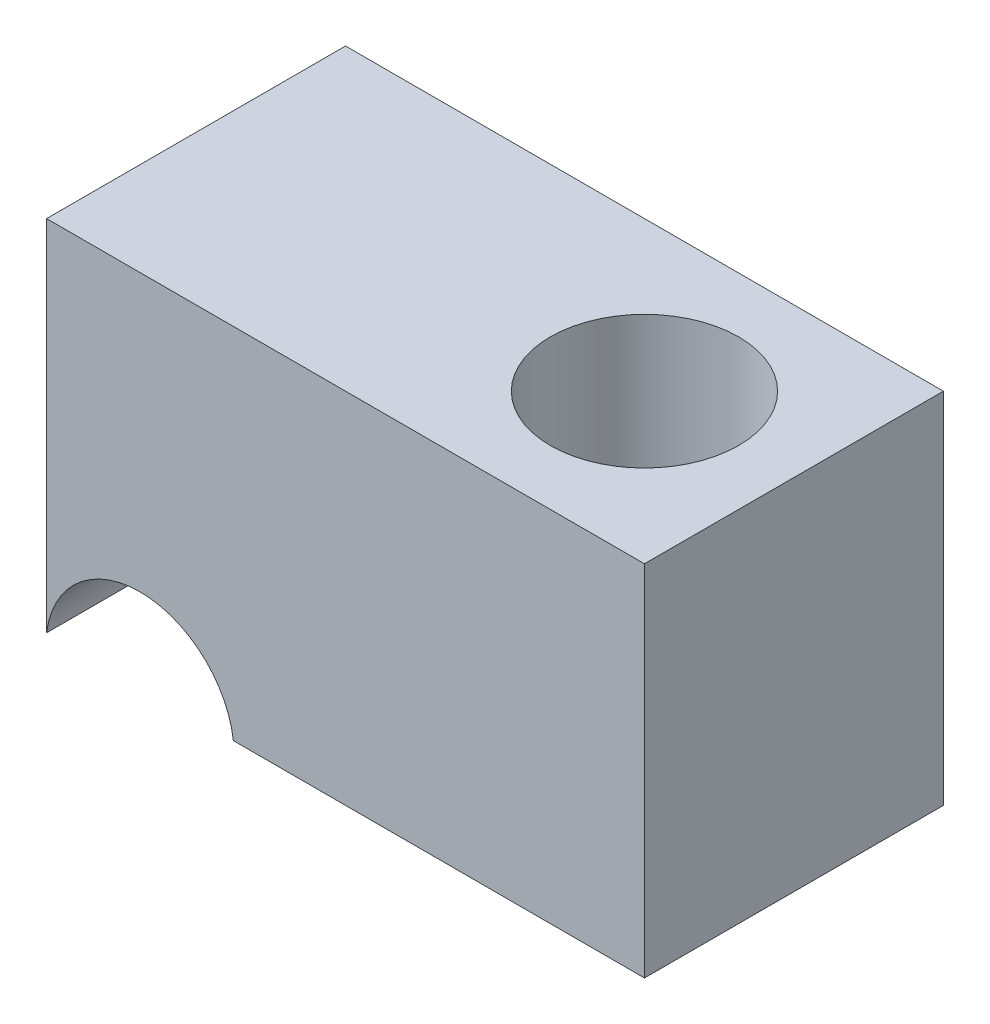
ISO-10303-21;
HEADER;
FILE_DESCRIPTION(('STEP AP214'),'2;1');
FILE_NAME('part.step','',(''),(''),'','','');
FILE_SCHEMA(('AUTOMOTIVE_DESIGN { 1 0 10303 214 1 1 1 1 }'));
ENDSEC;
DATA;
#1=APPLICATION_CONTEXT('core data for automotive mechanical design processes');
#2=APPLICATION_PROTOCOL_DEFINITION('international standard','automotive_design',2000,#1);
#3=PRODUCT_CONTEXT('',#1,'mechanical');
#4=PRODUCT('Part','Part','',(#3));
#5=PRODUCT_RELATED_PRODUCT_CATEGORY('part','',(#4));
#6=PRODUCT_DEFINITION_FORMATION('','',#4);
#7=PRODUCT_DEFINITION_CONTEXT('part definition',#1,'design');
#8=PRODUCT_DEFINITION('design','',#6,#7);
#9=PRODUCT_DEFINITION_SHAPE('','',#8);
#10=(LENGTH_UNIT() NAMED_UNIT(*) SI_UNIT(.MILLI.,.METRE.));
#11=(NAMED_UNIT(*) PLANE_ANGLE_UNIT() SI_UNIT($,.RADIAN.));
#12=(NAMED_UNIT(*) SI_UNIT($,.STERADIAN.) SOLID_ANGLE_UNIT());
#13=UNCERTAINTY_MEASURE_WITH_UNIT(LENGTH_MEASURE(1.E-05),#10,'distance_accuracy_value','');
#14=(GEOMETRIC_REPRESENTATION_CONTEXT(3) GLOBAL_UNCERTAINTY_ASSIGNED_CONTEXT((#13)) GLOBAL_UNIT_ASSIGNED_CONTEXT((#10,
#11,#12)) REPRESENTATION_CONTEXT('',''));
#15=CARTESIAN_POINT('',(0.,0.,0.));
#16=DIRECTION('',(0.,0.,1.));
#17=DIRECTION('',(1.,0.,0.));
#18=AXIS2_PLACEMENT_3D('',#15,#16,#17);
#19=CARTESIAN_POINT('',(0.,0.,6.35));
#20=DIRECTION('',(-1.,0.,0.));
#21=DIRECTION('',(0.,0.,1.));
#22=AXIS2_PLACEMENT_3D('',#19,#20,#21);
#23=PLANE('',#22);
#24=DIRECTION('',(0.,1.,0.));
#25=VECTOR('',#24,1.);
#26=CARTESIAN_POINT('',(0.,0.,0.));
#27=LINE('',#26,#25);
#28=CARTESIAN_POINT('',(0.,0.,0.));
#29=VERTEX_POINT('',#28);
#30=CARTESIAN_POINT('',(0.,7.62,0.));
#31=VERTEX_POINT('',#30);
#32=EDGE_CURVE('E122',#29,#31,#27,.T.);
#33=ORIENTED_EDGE('',*,*,#32,.T.);
#34=DIRECTION('',(0.,0.,-1.));
#35=VECTOR('',#34,1.);
#36=CARTESIAN_POINT('',(0.,7.62,6.35));
#37=LINE('',#36,#35);
#38=CARTESIAN_POINT('',(0.,7.62,6.35));
#39=VERTEX_POINT('',#38);
#40=EDGE_CURVE('E11',#39,#31,#37,.T.);
#41=ORIENTED_EDGE('',*,*,#40,.F.);
#42=DIRECTION('',(0.,1.,0.));
#43=VECTOR('',#42,1.);
#44=CARTESIAN_POINT('',(0.,0.,6.35));
#45=LINE('',#44,#43);
#46=CARTESIAN_POINT('',(0.,0.,6.35));
#47=VERTEX_POINT('',#46);
#48=EDGE_CURVE('E136',#47,#39,#45,.T.);
#49=ORIENTED_EDGE('',*,*,#48,.F.);
#50=DIRECTION('',(0.,0.,-1.));
#51=VECTOR('',#50,1.);
#52=CARTESIAN_POINT('',(0.,0.,6.35));
#53=LINE('',#52,#51);
#54=EDGE_CURVE('E118',#47,#29,#53,.T.);
#55=ORIENTED_EDGE('',*,*,#54,.T.);
#56=EDGE_LOOP('',(#33,#41,#49,#55));
#57=FACE_BOUND('',#56,.T.);
#58=ADVANCED_FACE('F43',(#57),#23,.F.);
#59=CARTESIAN_POINT('',(0.,7.62,6.35));
#60=DIRECTION('',(0.,-1.,0.));
#61=DIRECTION('',(1.,0.,0.));
#62=AXIS2_PLACEMENT_3D('',#59,#60,#61);
#63=PLANE('',#62);
#64=CARTESIAN_POINT('',(-3.175,7.62,3.175));
#65=DIRECTION('',(0.,-1.,0.));
#66=DIRECTION('',(0.,0.,-1.));
#67=AXIS2_PLACEMENT_3D('',#64,#65,#66);
#68=CIRCLE('',#67,2.);
#69=CARTESIAN_POINT('',(-3.175,7.62,1.175));
#70=VERTEX_POINT('',#69);
#71=EDGE_CURVE('E127',#70,#70,#68,.T.);
#72=ORIENTED_EDGE('',*,*,#71,.T.);
#73=EDGE_LOOP('',(#72));
#74=FACE_BOUND('',#73,.T.);
#75=DIRECTION('',(-1.,0.,0.));
#76=VECTOR('',#75,1.);
#77=CARTESIAN_POINT('',(0.,7.62,0.));
#78=LINE('',#77,#76);
#79=CARTESIAN_POINT('',(-12.7,7.62,0.));
#80=VERTEX_POINT('',#79);
#81=EDGE_CURVE('E126',#31,#80,#78,.T.);
#82=ORIENTED_EDGE('',*,*,#81,.T.);
#83=DIRECTION('',(0.,0.,-1.));
#84=VECTOR('',#83,1.);
#85=CARTESIAN_POINT('',(-12.7,7.62,6.35));
#86=LINE('',#85,#84);
#87=CARTESIAN_POINT('',(-12.7,7.62,6.35));
#88=VERTEX_POINT('',#87);
#89=EDGE_CURVE('E52',#88,#80,#86,.T.);
#90=ORIENTED_EDGE('',*,*,#89,.F.);
#91=DIRECTION('',(-1.,0.,0.));
#92=VECTOR('',#91,1.);
#93=CARTESIAN_POINT('',(0.,7.62,6.35));
#94=LINE('',#93,#92);
#95=EDGE_CURVE('E94',#39,#88,#94,.T.);
#96=ORIENTED_EDGE('',*,*,#95,.F.);
#97=ORIENTED_EDGE('',*,*,#40,.T.);
#98=EDGE_LOOP('',(#82,#90,#96,#97));
#99=FACE_BOUND('',#98,.T.);
#100=ADVANCED_FACE('F160',(#74,#99),#63,.F.);
#101=CARTESIAN_POINT('',(-12.7,7.62,6.35));
#102=DIRECTION('',(1.,0.,0.));
#103=DIRECTION('',(0.,1.,0.));
#104=AXIS2_PLACEMENT_3D('',#101,#102,#103);
#105=PLANE('',#104);
#106=DIRECTION('',(0.,-1.,0.));
#107=VECTOR('',#106,1.);
#108=CARTESIAN_POINT('',(-12.7,7.62,0.));
#109=LINE('',#108,#107);
#110=CARTESIAN_POINT('',(-12.7,0.,0.));
#111=VERTEX_POINT('',#110);
#112=EDGE_CURVE('E110',#80,#111,#109,.T.);
#113=ORIENTED_EDGE('',*,*,#112,.T.);
#114=DIRECTION('',(0.,0.,-1.));
#115=VECTOR('',#114,1.);
#116=CARTESIAN_POINT('',(-12.7,0.,6.35));
#117=LINE('',#116,#115);
#118=CARTESIAN_POINT('',(-12.7,0.,6.35));
#119=VERTEX_POINT('',#118);
#120=EDGE_CURVE('E107',#119,#111,#117,.T.);
#121=ORIENTED_EDGE('',*,*,#120,.F.);
#122=DIRECTION('',(0.,-1.,0.));
#123=VECTOR('',#122,1.);
#124=CARTESIAN_POINT('',(-12.7,7.62,6.35));
#125=LINE('',#124,#123);
#126=EDGE_CURVE('E98',#88,#119,#125,.T.);
#127=ORIENTED_EDGE('',*,*,#126,.F.);
#128=ORIENTED_EDGE('',*,*,#89,.T.);
#129=EDGE_LOOP('',(#113,#121,#127,#128));
#130=FACE_BOUND('',#129,.T.);
#131=ADVANCED_FACE('F108',(#130),#105,.F.);
#132=CARTESIAN_POINT('',(-10.7161945659919,-0.254000000000001,6.35));
#133=DIRECTION('',(0.,0.,-1.));
#134=DIRECTION('',(-1.,0.,0.));
#135=AXIS2_PLACEMENT_3D('',#132,#133,#134);
#136=CYLINDRICAL_SURFACE('',#135,2.);
#137=CARTESIAN_POINT('',(-10.7161945659919,-0.254000000000001,0.));
#138=DIRECTION('',(0.,0.,-1.));
#139=DIRECTION('',(-1.,0.,0.));
#140=AXIS2_PLACEMENT_3D('',#137,#138,#139);
#141=CIRCLE('',#140,2.);
#142=CARTESIAN_POINT('',(-8.73238913198383,0.,0.));
#143=VERTEX_POINT('',#142);
#144=EDGE_CURVE('E80',#111,#143,#141,.T.);
#145=ORIENTED_EDGE('',*,*,#144,.T.);
#146=DIRECTION('',(0.,0.,-1.));
#147=VECTOR('',#146,1.);
#148=CARTESIAN_POINT('',(-8.73238913198383,0.,6.35));
#149=LINE('',#148,#147);
#150=CARTESIAN_POINT('',(-8.73238913198383,0.,6.35));
#151=VERTEX_POINT('',#150);
#152=EDGE_CURVE('E112',#151,#143,#149,.T.);
#153=ORIENTED_EDGE('',*,*,#152,.F.);
#154=CARTESIAN_POINT('',(-10.7161945659919,-0.254000000000001,6.35));
#155=DIRECTION('',(0.,0.,-1.));
#156=DIRECTION('',(-1.,0.,0.));
#157=AXIS2_PLACEMENT_3D('',#154,#155,#156);
#158=CIRCLE('',#157,2.);
#159=EDGE_CURVE('E102',#119,#151,#158,.T.);
#160=ORIENTED_EDGE('',*,*,#159,.F.);
#161=ORIENTED_EDGE('',*,*,#120,.T.);
#162=EDGE_LOOP('',(#145,#153,#160,#161));
#163=FACE_BOUND('',#162,.T.);
#164=ADVANCED_FACE('F114',(#163),#136,.F.);
#165=CARTESIAN_POINT('',(0.,0.,6.35));
#166=DIRECTION('',(0.,1.,0.));
#167=DIRECTION('',(-1.,0.,0.));
#168=AXIS2_PLACEMENT_3D('',#165,#166,#167);
#169=PLANE('',#168);
#170=CARTESIAN_POINT('',(-3.175,0.,3.175));
#171=DIRECTION('',(0.,-1.,0.));
#172=DIRECTION('',(0.,0.,-1.));
#173=AXIS2_PLACEMENT_3D('',#170,#171,#172);
#174=CIRCLE('',#173,2.025);
#175=CARTESIAN_POINT('',(-3.175,0.,1.15));
#176=VERTEX_POINT('',#175);
#177=EDGE_CURVE('E177',#176,#176,#174,.T.);
#178=ORIENTED_EDGE('',*,*,#177,.F.);
#179=EDGE_LOOP('',(#178));
#180=FACE_BOUND('',#179,.T.);
#181=DIRECTION('',(1.,0.,0.));
#182=VECTOR('',#181,1.);
#183=CARTESIAN_POINT('',(0.,0.,0.));
#184=LINE('',#183,#182);
#185=EDGE_CURVE('E86',#143,#29,#184,.T.);
#186=ORIENTED_EDGE('',*,*,#185,.T.);
#187=ORIENTED_EDGE('',*,*,#54,.F.);
#188=DIRECTION('',(1.,0.,0.));
#189=VECTOR('',#188,1.);
#190=CARTESIAN_POINT('',(0.,0.,6.35));
#191=LINE('',#190,#189);
#192=EDGE_CURVE('E60',#151,#47,#191,.T.);
#193=ORIENTED_EDGE('',*,*,#192,.F.);
#194=ORIENTED_EDGE('',*,*,#152,.T.);
#195=EDGE_LOOP('',(#186,#187,#193,#194));
#196=FACE_BOUND('',#195,.T.);
#197=ADVANCED_FACE('F147',(#180,#196),#169,.F.);
#198=CARTESIAN_POINT('',(-10.7161945659919,-0.254000000000001,6.35));
#199=DIRECTION('',(0.,0.,-1.));
#200=DIRECTION('',(-1.,0.,0.));
#201=AXIS2_PLACEMENT_3D('',#198,#199,#200);
#202=PLANE('',#201);
#203=ORIENTED_EDGE('',*,*,#48,.T.);
#204=ORIENTED_EDGE('',*,*,#95,.T.);
#205=ORIENTED_EDGE('',*,*,#126,.T.);
#206=ORIENTED_EDGE('',*,*,#159,.T.);
#207=ORIENTED_EDGE('',*,*,#192,.T.);
#208=EDGE_LOOP('',(#203,#204,#205,#206,#207));
#209=FACE_BOUND('',#208,.T.);
#210=ADVANCED_FACE('F100',(#209),#202,.F.);
#211=CARTESIAN_POINT('',(-10.7161945659919,-0.254000000000001,0.));
#212=DIRECTION('',(0.,0.,-1.));
#213=DIRECTION('',(-1.,0.,0.));
#214=AXIS2_PLACEMENT_3D('',#211,#212,#213);
#215=PLANE('',#214);
#216=ORIENTED_EDGE('',*,*,#32,.F.);
#217=ORIENTED_EDGE('',*,*,#185,.F.);
#218=ORIENTED_EDGE('',*,*,#144,.F.);
#219=ORIENTED_EDGE('',*,*,#112,.F.);
#220=ORIENTED_EDGE('',*,*,#81,.F.);
#221=EDGE_LOOP('',(#216,#217,#218,#219,#220));
#222=FACE_BOUND('',#221,.T.);
#223=ADVANCED_FACE('F143',(#222),#215,.T.);
#224=CARTESIAN_POINT('',(-3.175,0.,3.175));
#225=DIRECTION('',(0.,-1.,0.));
#226=DIRECTION('',(0.,0.,-1.));
#227=AXIS2_PLACEMENT_3D('',#224,#225,#226);
#228=CYLINDRICAL_SURFACE('',#227,2.);
#229=ORIENTED_EDGE('',*,*,#71,.F.);
#230=EDGE_LOOP('',(#229));
#231=FACE_BOUND('',#230,.T.);
#232=CARTESIAN_POINT('',(-3.175,0.0250000000000003,3.175));
#233=DIRECTION('',(0.,-1.,0.));
#234=DIRECTION('',(0.,0.,-1.));
#235=AXIS2_PLACEMENT_3D('',#232,#233,#234);
#236=CIRCLE('',#235,2.);
#237=CARTESIAN_POINT('',(-3.175,0.0250000000000003,1.175));
#238=VERTEX_POINT('',#237);
#239=EDGE_CURVE('E173',#238,#238,#236,.T.);
#240=ORIENTED_EDGE('',*,*,#239,.T.);
#241=EDGE_LOOP('',(#240));
#242=FACE_BOUND('',#241,.T.);
#243=ADVANCED_FACE('F188',(#231,#242),#228,.F.);
#244=CARTESIAN_POINT('',(-3.175,0.,3.175));
#245=DIRECTION('',(0.,-1.,0.));
#246=DIRECTION('',(0.,0.,-1.));
#247=AXIS2_PLACEMENT_3D('',#244,#245,#246);
#248=CONICAL_SURFACE('',#247,2.025,0.78539816339744);
#249=ORIENTED_EDGE('',*,*,#239,.F.);
#250=EDGE_LOOP('',(#249));
#251=FACE_BOUND('',#250,.T.);
#252=ORIENTED_EDGE('',*,*,#177,.T.);
#253=EDGE_LOOP('',(#252));
#254=FACE_BOUND('',#253,.T.);
#255=ADVANCED_FACE('F186',(#251,#254),#248,.F.);
#256=CLOSED_SHELL('',(#58,#100,#131,#164,#197,#210,#223,#243,#255));
#257=MANIFOLD_SOLID_BREP('B2',#256);
#258=ADVANCED_BREP_SHAPE_REPRESENTATION('',(#18,#257),#14);
#259=SHAPE_DEFINITION_REPRESENTATION(#9,#258);
ENDSEC;
END-ISO-10303-21;
